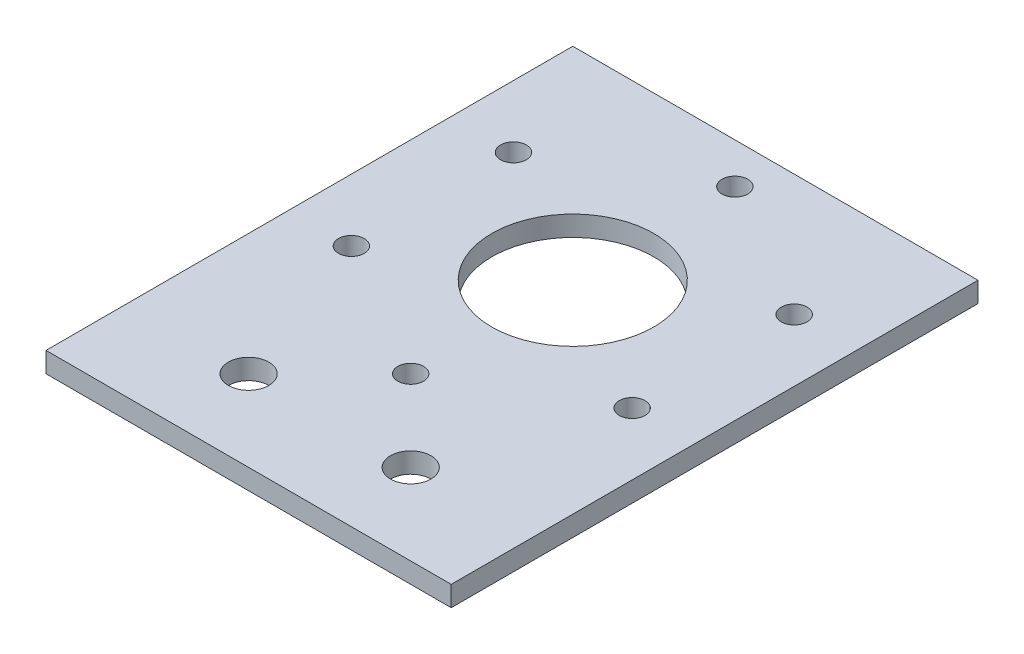
ISO-10303-21;
HEADER;
FILE_DESCRIPTION(('STEP AP214'),'2;1');
FILE_NAME('part.step','',(''),(''),'','','');
FILE_SCHEMA(('AUTOMOTIVE_DESIGN { 1 0 10303 214 1 1 1 1 }'));
ENDSEC;
DATA;
#1=APPLICATION_CONTEXT('core data for automotive mechanical design processes');
#2=APPLICATION_PROTOCOL_DEFINITION('international standard','automotive_design',2000,#1);
#3=PRODUCT_CONTEXT('',#1,'mechanical');
#4=PRODUCT('Part','Part','',(#3));
#5=PRODUCT_RELATED_PRODUCT_CATEGORY('part','',(#4));
#6=PRODUCT_DEFINITION_FORMATION('','',#4);
#7=PRODUCT_DEFINITION_CONTEXT('part definition',#1,'design');
#8=PRODUCT_DEFINITION('design','',#6,#7);
#9=PRODUCT_DEFINITION_SHAPE('','',#8);
#10=(LENGTH_UNIT() NAMED_UNIT(*) SI_UNIT(.MILLI.,.METRE.));
#11=(NAMED_UNIT(*) PLANE_ANGLE_UNIT() SI_UNIT($,.RADIAN.));
#12=(NAMED_UNIT(*) SI_UNIT($,.STERADIAN.) SOLID_ANGLE_UNIT());
#13=UNCERTAINTY_MEASURE_WITH_UNIT(LENGTH_MEASURE(1.E-05),#10,'distance_accuracy_value','');
#14=(GEOMETRIC_REPRESENTATION_CONTEXT(3) GLOBAL_UNCERTAINTY_ASSIGNED_CONTEXT((#13)) GLOBAL_UNIT_ASSIGNED_CONTEXT((#10,
#11,#12)) REPRESENTATION_CONTEXT('',''));
#15=CARTESIAN_POINT('',(0.,0.,0.));
#16=DIRECTION('',(0.,0.,1.));
#17=DIRECTION('',(1.,0.,0.));
#18=AXIS2_PLACEMENT_3D('',#15,#16,#17);
#19=CARTESIAN_POINT('',(0.,3.175,0.));
#20=DIRECTION('',(0.,-1.,0.));
#21=DIRECTION('',(0.,0.,-1.));
#22=AXIS2_PLACEMENT_3D('',#19,#20,#21);
#23=PLANE('',#22);
#24=CARTESIAN_POINT('',(19.05,3.175,-12.7));
#25=DIRECTION('',(0.,1.,0.));
#26=DIRECTION('',(0.,0.,1.));
#27=AXIS2_PLACEMENT_3D('',#24,#25,#26);
#28=CIRCLE('',#27,3.175);
#29=CARTESIAN_POINT('',(19.05,3.175,-9.525));
#30=VERTEX_POINT('',#29);
#31=EDGE_CURVE('E160',#30,#30,#28,.T.);
#32=ORIENTED_EDGE('',*,*,#31,.F.);
#33=EDGE_LOOP('',(#32));
#34=FACE_BOUND('',#33,.T.);
#35=CARTESIAN_POINT('',(44.45,3.175,-12.7));
#36=DIRECTION('',(0.,1.,0.));
#37=DIRECTION('',(0.,0.,1.));
#38=AXIS2_PLACEMENT_3D('',#35,#36,#37);
#39=CIRCLE('',#38,3.175);
#40=CARTESIAN_POINT('',(44.45,3.175,-9.525));
#41=VERTEX_POINT('',#40);
#42=EDGE_CURVE('E154',#41,#41,#39,.T.);
#43=ORIENTED_EDGE('',*,*,#42,.F.);
#44=EDGE_LOOP('',(#43));
#45=FACE_BOUND('',#44,.T.);
#46=DIRECTION('',(0.,0.,1.));
#47=VECTOR('',#46,1.);
#48=CARTESIAN_POINT('',(0.,3.175,0.));
#49=LINE('',#48,#47);
#50=CARTESIAN_POINT('',(0.,3.175,-82.55));
#51=VERTEX_POINT('',#50);
#52=CARTESIAN_POINT('',(0.,3.175,0.));
#53=VERTEX_POINT('',#52);
#54=EDGE_CURVE('E85',#51,#53,#49,.T.);
#55=ORIENTED_EDGE('',*,*,#54,.T.);
#56=DIRECTION('',(1.,0.,0.));
#57=VECTOR('',#56,1.);
#58=CARTESIAN_POINT('',(0.,3.175,0.));
#59=LINE('',#58,#57);
#60=CARTESIAN_POINT('',(63.5,3.175,0.));
#61=VERTEX_POINT('',#60);
#62=EDGE_CURVE('E80',#53,#61,#59,.T.);
#63=ORIENTED_EDGE('',*,*,#62,.T.);
#64=DIRECTION('',(0.,0.,-1.));
#65=VECTOR('',#64,1.);
#66=CARTESIAN_POINT('',(63.5,3.175,0.));
#67=LINE('',#66,#65);
#68=CARTESIAN_POINT('',(63.5,3.175,-82.55));
#69=VERTEX_POINT('',#68);
#70=EDGE_CURVE('E83',#61,#69,#67,.T.);
#71=ORIENTED_EDGE('',*,*,#70,.T.);
#72=DIRECTION('',(-1.,0.,0.));
#73=VECTOR('',#72,1.);
#74=CARTESIAN_POINT('',(0.,3.175,-82.55));
#75=LINE('',#74,#73);
#76=EDGE_CURVE('E50',#69,#51,#75,.T.);
#77=ORIENTED_EDGE('',*,*,#76,.T.);
#78=EDGE_LOOP('',(#55,#63,#71,#77));
#79=FACE_BOUND('',#78,.T.);
#80=CARTESIAN_POINT('',(31.75,3.175,-50.8));
#81=DIRECTION('',(0.,1.,0.));
#82=DIRECTION('',(0.,0.,1.));
#83=AXIS2_PLACEMENT_3D('',#80,#81,#82);
#84=CIRCLE('',#83,12.7);
#85=CARTESIAN_POINT('',(31.75,3.175,-38.1));
#86=VERTEX_POINT('',#85);
#87=EDGE_CURVE('E100',#86,#86,#84,.T.);
#88=ORIENTED_EDGE('',*,*,#87,.F.);
#89=EDGE_LOOP('',(#88));
#90=FACE_BOUND('',#89,.T.);
#91=CARTESIAN_POINT('',(9.75295474387527,3.175,-63.5));
#92=DIRECTION('',(0.,1.,0.));
#93=DIRECTION('',(0.,0.,1.));
#94=AXIS2_PLACEMENT_3D('',#91,#92,#93);
#95=CIRCLE('',#94,2.0193);
#96=CARTESIAN_POINT('',(9.75295474387527,3.175,-61.4807));
#97=VERTEX_POINT('',#96);
#98=EDGE_CURVE('E115',#97,#97,#95,.T.);
#99=ORIENTED_EDGE('',*,*,#98,.F.);
#100=EDGE_LOOP('',(#99));
#101=FACE_BOUND('',#100,.T.);
#102=CARTESIAN_POINT('',(31.75,3.175,-76.2));
#103=DIRECTION('',(0.,1.,0.));
#104=DIRECTION('',(0.,0.,1.));
#105=AXIS2_PLACEMENT_3D('',#102,#103,#104);
#106=CIRCLE('',#105,2.0193);
#107=CARTESIAN_POINT('',(31.75,3.175,-74.1807));
#108=VERTEX_POINT('',#107);
#109=EDGE_CURVE('E121',#108,#108,#106,.T.);
#110=ORIENTED_EDGE('',*,*,#109,.F.);
#111=EDGE_LOOP('',(#110));
#112=FACE_BOUND('',#111,.T.);
#113=CARTESIAN_POINT('',(53.7470452561248,3.175,-63.5));
#114=DIRECTION('',(0.,1.,0.));
#115=DIRECTION('',(0.,0.,1.));
#116=AXIS2_PLACEMENT_3D('',#113,#114,#115);
#117=CIRCLE('',#116,2.0193);
#118=CARTESIAN_POINT('',(53.7470452561248,3.175,-61.4807));
#119=VERTEX_POINT('',#118);
#120=EDGE_CURVE('E127',#119,#119,#117,.T.);
#121=ORIENTED_EDGE('',*,*,#120,.F.);
#122=EDGE_LOOP('',(#121));
#123=FACE_BOUND('',#122,.T.);
#124=CARTESIAN_POINT('',(53.7470452561248,3.175,-38.1));
#125=DIRECTION('',(0.,1.,0.));
#126=DIRECTION('',(0.,0.,1.));
#127=AXIS2_PLACEMENT_3D('',#124,#125,#126);
#128=CIRCLE('',#127,2.0193);
#129=CARTESIAN_POINT('',(53.7470452561248,3.175,-36.0807));
#130=VERTEX_POINT('',#129);
#131=EDGE_CURVE('E133',#130,#130,#128,.T.);
#132=ORIENTED_EDGE('',*,*,#131,.F.);
#133=EDGE_LOOP('',(#132));
#134=FACE_BOUND('',#133,.T.);
#135=CARTESIAN_POINT('',(31.75,3.175,-25.4));
#136=DIRECTION('',(0.,1.,0.));
#137=DIRECTION('',(0.,0.,1.));
#138=AXIS2_PLACEMENT_3D('',#135,#136,#137);
#139=CIRCLE('',#138,2.0193);
#140=CARTESIAN_POINT('',(31.75,3.175,-23.3807));
#141=VERTEX_POINT('',#140);
#142=EDGE_CURVE('E139',#141,#141,#139,.T.);
#143=ORIENTED_EDGE('',*,*,#142,.F.);
#144=EDGE_LOOP('',(#143));
#145=FACE_BOUND('',#144,.T.);
#146=CARTESIAN_POINT('',(9.75295474387527,3.175,-38.1));
#147=DIRECTION('',(0.,1.,0.));
#148=DIRECTION('',(0.,0.,1.));
#149=AXIS2_PLACEMENT_3D('',#146,#147,#148);
#150=CIRCLE('',#149,2.0193);
#151=CARTESIAN_POINT('',(9.75295474387527,3.175,-36.0807));
#152=VERTEX_POINT('',#151);
#153=EDGE_CURVE('E145',#152,#152,#150,.T.);
#154=ORIENTED_EDGE('',*,*,#153,.F.);
#155=EDGE_LOOP('',(#154));
#156=FACE_BOUND('',#155,.T.);
#157=ADVANCED_FACE('F33',(#34,#45,#79,#90,#101,#112,#123,#134,#145,#156),#23,.F.);
#158=CARTESIAN_POINT('',(0.,0.,0.));
#159=DIRECTION('',(0.,-1.,0.));
#160=DIRECTION('',(0.,0.,-1.));
#161=AXIS2_PLACEMENT_3D('',#158,#159,#160);
#162=PLANE('',#161);
#163=CARTESIAN_POINT('',(19.05,0.,-12.7));
#164=DIRECTION('',(0.,1.,0.));
#165=DIRECTION('',(0.,0.,1.));
#166=AXIS2_PLACEMENT_3D('',#163,#164,#165);
#167=CIRCLE('',#166,3.175);
#168=CARTESIAN_POINT('',(19.05,0.,-9.525));
#169=VERTEX_POINT('',#168);
#170=EDGE_CURVE('E151',#169,#169,#167,.T.);
#171=ORIENTED_EDGE('',*,*,#170,.T.);
#172=EDGE_LOOP('',(#171));
#173=FACE_BOUND('',#172,.T.);
#174=CARTESIAN_POINT('',(44.45,0.,-12.7));
#175=DIRECTION('',(0.,1.,0.));
#176=DIRECTION('',(0.,0.,1.));
#177=AXIS2_PLACEMENT_3D('',#174,#175,#176);
#178=CIRCLE('',#177,3.175);
#179=CARTESIAN_POINT('',(44.45,0.,-9.525));
#180=VERTEX_POINT('',#179);
#181=EDGE_CURVE('E157',#180,#180,#178,.T.);
#182=ORIENTED_EDGE('',*,*,#181,.T.);
#183=EDGE_LOOP('',(#182));
#184=FACE_BOUND('',#183,.T.);
#185=CARTESIAN_POINT('',(31.75,0.,-25.4));
#186=DIRECTION('',(0.,1.,0.));
#187=DIRECTION('',(0.,0.,1.));
#188=AXIS2_PLACEMENT_3D('',#185,#186,#187);
#189=CIRCLE('',#188,2.0193);
#190=CARTESIAN_POINT('',(31.75,0.,-23.3807));
#191=VERTEX_POINT('',#190);
#192=EDGE_CURVE('E142',#191,#191,#189,.T.);
#193=ORIENTED_EDGE('',*,*,#192,.T.);
#194=EDGE_LOOP('',(#193));
#195=FACE_BOUND('',#194,.T.);
#196=CARTESIAN_POINT('',(53.7470452561248,0.,-63.5));
#197=DIRECTION('',(0.,1.,0.));
#198=DIRECTION('',(0.,0.,1.));
#199=AXIS2_PLACEMENT_3D('',#196,#197,#198);
#200=CIRCLE('',#199,2.0193);
#201=CARTESIAN_POINT('',(53.7470452561248,0.,-61.4807));
#202=VERTEX_POINT('',#201);
#203=EDGE_CURVE('E130',#202,#202,#200,.T.);
#204=ORIENTED_EDGE('',*,*,#203,.T.);
#205=EDGE_LOOP('',(#204));
#206=FACE_BOUND('',#205,.T.);
#207=CARTESIAN_POINT('',(9.75295474387527,0.,-63.5));
#208=DIRECTION('',(0.,1.,0.));
#209=DIRECTION('',(0.,0.,1.));
#210=AXIS2_PLACEMENT_3D('',#207,#208,#209);
#211=CIRCLE('',#210,2.0193);
#212=CARTESIAN_POINT('',(9.75295474387527,0.,-61.4807));
#213=VERTEX_POINT('',#212);
#214=EDGE_CURVE('E118',#213,#213,#211,.T.);
#215=ORIENTED_EDGE('',*,*,#214,.T.);
#216=EDGE_LOOP('',(#215));
#217=FACE_BOUND('',#216,.T.);
#218=DIRECTION('',(0.,0.,1.));
#219=VECTOR('',#218,1.);
#220=CARTESIAN_POINT('',(0.,0.,0.));
#221=LINE('',#220,#219);
#222=CARTESIAN_POINT('',(0.,0.,-82.55));
#223=VERTEX_POINT('',#222);
#224=CARTESIAN_POINT('',(0.,0.,0.));
#225=VERTEX_POINT('',#224);
#226=EDGE_CURVE('E97',#223,#225,#221,.T.);
#227=ORIENTED_EDGE('',*,*,#226,.F.);
#228=DIRECTION('',(-1.,0.,0.));
#229=VECTOR('',#228,1.);
#230=CARTESIAN_POINT('',(0.,0.,-82.55));
#231=LINE('',#230,#229);
#232=CARTESIAN_POINT('',(63.5,0.,-82.55));
#233=VERTEX_POINT('',#232);
#234=EDGE_CURVE('E73',#233,#223,#231,.T.);
#235=ORIENTED_EDGE('',*,*,#234,.F.);
#236=DIRECTION('',(0.,0.,-1.));
#237=VECTOR('',#236,1.);
#238=CARTESIAN_POINT('',(63.5,0.,0.));
#239=LINE('',#238,#237);
#240=CARTESIAN_POINT('',(63.5,0.,0.));
#241=VERTEX_POINT('',#240);
#242=EDGE_CURVE('E67',#241,#233,#239,.T.);
#243=ORIENTED_EDGE('',*,*,#242,.F.);
#244=DIRECTION('',(1.,0.,0.));
#245=VECTOR('',#244,1.);
#246=CARTESIAN_POINT('',(0.,0.,0.));
#247=LINE('',#246,#245);
#248=EDGE_CURVE('E89',#225,#241,#247,.T.);
#249=ORIENTED_EDGE('',*,*,#248,.F.);
#250=EDGE_LOOP('',(#227,#235,#243,#249));
#251=FACE_BOUND('',#250,.T.);
#252=CARTESIAN_POINT('',(31.75,0.,-50.8));
#253=DIRECTION('',(0.,1.,0.));
#254=DIRECTION('',(0.,0.,1.));
#255=AXIS2_PLACEMENT_3D('',#252,#253,#254);
#256=CIRCLE('',#255,12.7);
#257=CARTESIAN_POINT('',(31.75,0.,-38.1));
#258=VERTEX_POINT('',#257);
#259=EDGE_CURVE('E112',#258,#258,#256,.T.);
#260=ORIENTED_EDGE('',*,*,#259,.T.);
#261=EDGE_LOOP('',(#260));
#262=FACE_BOUND('',#261,.T.);
#263=CARTESIAN_POINT('',(31.75,0.,-76.2));
#264=DIRECTION('',(0.,1.,0.));
#265=DIRECTION('',(0.,0.,1.));
#266=AXIS2_PLACEMENT_3D('',#263,#264,#265);
#267=CIRCLE('',#266,2.0193);
#268=CARTESIAN_POINT('',(31.75,0.,-74.1807));
#269=VERTEX_POINT('',#268);
#270=EDGE_CURVE('E124',#269,#269,#267,.T.);
#271=ORIENTED_EDGE('',*,*,#270,.T.);
#272=EDGE_LOOP('',(#271));
#273=FACE_BOUND('',#272,.T.);
#274=CARTESIAN_POINT('',(53.7470452561248,0.,-38.1));
#275=DIRECTION('',(0.,1.,0.));
#276=DIRECTION('',(0.,0.,1.));
#277=AXIS2_PLACEMENT_3D('',#274,#275,#276);
#278=CIRCLE('',#277,2.0193);
#279=CARTESIAN_POINT('',(53.7470452561248,0.,-36.0807));
#280=VERTEX_POINT('',#279);
#281=EDGE_CURVE('E136',#280,#280,#278,.T.);
#282=ORIENTED_EDGE('',*,*,#281,.T.);
#283=EDGE_LOOP('',(#282));
#284=FACE_BOUND('',#283,.T.);
#285=CARTESIAN_POINT('',(9.75295474387527,0.,-38.1));
#286=DIRECTION('',(0.,1.,0.));
#287=DIRECTION('',(0.,0.,1.));
#288=AXIS2_PLACEMENT_3D('',#285,#286,#287);
#289=CIRCLE('',#288,2.0193);
#290=CARTESIAN_POINT('',(9.75295474387527,0.,-36.0807));
#291=VERTEX_POINT('',#290);
#292=EDGE_CURVE('E148',#291,#291,#289,.T.);
#293=ORIENTED_EDGE('',*,*,#292,.T.);
#294=EDGE_LOOP('',(#293));
#295=FACE_BOUND('',#294,.T.);
#296=ADVANCED_FACE('F108',(#173,#184,#195,#206,#217,#251,#262,#273,#284,#295),#162,.T.);
#297=CARTESIAN_POINT('',(0.,3.175,0.));
#298=DIRECTION('',(1.,0.,0.));
#299=DIRECTION('',(0.,0.,-1.));
#300=AXIS2_PLACEMENT_3D('',#297,#298,#299);
#301=PLANE('',#300);
#302=ORIENTED_EDGE('',*,*,#226,.T.);
#303=DIRECTION('',(0.,-1.,0.));
#304=VECTOR('',#303,1.);
#305=CARTESIAN_POINT('',(0.,3.175,0.));
#306=LINE('',#305,#304);
#307=EDGE_CURVE('E11',#53,#225,#306,.T.);
#308=ORIENTED_EDGE('',*,*,#307,.F.);
#309=ORIENTED_EDGE('',*,*,#54,.F.);
#310=DIRECTION('',(0.,-1.,0.));
#311=VECTOR('',#310,1.);
#312=CARTESIAN_POINT('',(0.,3.175,-82.55));
#313=LINE('',#312,#311);
#314=EDGE_CURVE('E93',#51,#223,#313,.T.);
#315=ORIENTED_EDGE('',*,*,#314,.T.);
#316=EDGE_LOOP('',(#302,#308,#309,#315));
#317=FACE_BOUND('',#316,.T.);
#318=ADVANCED_FACE('F35',(#317),#301,.F.);
#319=CARTESIAN_POINT('',(0.,3.175,0.));
#320=DIRECTION('',(0.,0.,-1.));
#321=DIRECTION('',(-1.,0.,0.));
#322=AXIS2_PLACEMENT_3D('',#319,#320,#321);
#323=PLANE('',#322);
#324=ORIENTED_EDGE('',*,*,#248,.T.);
#325=DIRECTION('',(0.,-1.,0.));
#326=VECTOR('',#325,1.);
#327=CARTESIAN_POINT('',(63.5,3.175,0.));
#328=LINE('',#327,#326);
#329=EDGE_CURVE('E42',#61,#241,#328,.T.);
#330=ORIENTED_EDGE('',*,*,#329,.F.);
#331=ORIENTED_EDGE('',*,*,#62,.F.);
#332=ORIENTED_EDGE('',*,*,#307,.T.);
#333=EDGE_LOOP('',(#324,#330,#331,#332));
#334=FACE_BOUND('',#333,.T.);
#335=ADVANCED_FACE('F88',(#334),#323,.F.);
#336=CARTESIAN_POINT('',(63.5,3.175,0.));
#337=DIRECTION('',(-1.,0.,0.));
#338=DIRECTION('',(0.,0.,1.));
#339=AXIS2_PLACEMENT_3D('',#336,#337,#338);
#340=PLANE('',#339);
#341=ORIENTED_EDGE('',*,*,#242,.T.);
#342=DIRECTION('',(0.,-1.,0.));
#343=VECTOR('',#342,1.);
#344=CARTESIAN_POINT('',(63.5,3.175,-82.55));
#345=LINE('',#344,#343);
#346=EDGE_CURVE('E90',#69,#233,#345,.T.);
#347=ORIENTED_EDGE('',*,*,#346,.F.);
#348=ORIENTED_EDGE('',*,*,#70,.F.);
#349=ORIENTED_EDGE('',*,*,#329,.T.);
#350=EDGE_LOOP('',(#341,#347,#348,#349));
#351=FACE_BOUND('',#350,.T.);
#352=ADVANCED_FACE('F91',(#351),#340,.F.);
#353=CARTESIAN_POINT('',(0.,3.175,-82.55));
#354=DIRECTION('',(0.,0.,1.));
#355=DIRECTION('',(1.,0.,0.));
#356=AXIS2_PLACEMENT_3D('',#353,#354,#355);
#357=PLANE('',#356);
#358=ORIENTED_EDGE('',*,*,#234,.T.);
#359=ORIENTED_EDGE('',*,*,#314,.F.);
#360=ORIENTED_EDGE('',*,*,#76,.F.);
#361=ORIENTED_EDGE('',*,*,#346,.T.);
#362=EDGE_LOOP('',(#358,#359,#360,#361));
#363=FACE_BOUND('',#362,.T.);
#364=ADVANCED_FACE('F105',(#363),#357,.F.);
#365=CARTESIAN_POINT('',(31.75,3.175,-50.8));
#366=DIRECTION('',(0.,-1.,0.));
#367=DIRECTION('',(0.,0.,-1.));
#368=AXIS2_PLACEMENT_3D('',#365,#366,#367);
#369=CYLINDRICAL_SURFACE('',#368,12.7);
#370=ORIENTED_EDGE('',*,*,#87,.T.);
#371=EDGE_LOOP('',(#370));
#372=FACE_BOUND('',#371,.T.);
#373=ORIENTED_EDGE('',*,*,#259,.F.);
#374=EDGE_LOOP('',(#373));
#375=FACE_BOUND('',#374,.T.);
#376=ADVANCED_FACE('F210',(#372,#375),#369,.F.);
#377=CARTESIAN_POINT('',(9.75295474387527,3.175,-63.5));
#378=DIRECTION('',(0.,-1.,0.));
#379=DIRECTION('',(0.,0.,-1.));
#380=AXIS2_PLACEMENT_3D('',#377,#378,#379);
#381=CYLINDRICAL_SURFACE('',#380,2.0193);
#382=ORIENTED_EDGE('',*,*,#98,.T.);
#383=EDGE_LOOP('',(#382));
#384=FACE_BOUND('',#383,.T.);
#385=ORIENTED_EDGE('',*,*,#214,.F.);
#386=EDGE_LOOP('',(#385));
#387=FACE_BOUND('',#386,.T.);
#388=ADVANCED_FACE('F206',(#384,#387),#381,.F.);
#389=CARTESIAN_POINT('',(31.75,3.175,-76.2));
#390=DIRECTION('',(0.,-1.,0.));
#391=DIRECTION('',(0.,0.,-1.));
#392=AXIS2_PLACEMENT_3D('',#389,#390,#391);
#393=CYLINDRICAL_SURFACE('',#392,2.0193);
#394=ORIENTED_EDGE('',*,*,#109,.T.);
#395=EDGE_LOOP('',(#394));
#396=FACE_BOUND('',#395,.T.);
#397=ORIENTED_EDGE('',*,*,#270,.F.);
#398=EDGE_LOOP('',(#397));
#399=FACE_BOUND('',#398,.T.);
#400=ADVANCED_FACE('F202',(#396,#399),#393,.F.);
#401=CARTESIAN_POINT('',(53.7470452561248,3.175,-63.5));
#402=DIRECTION('',(0.,-1.,0.));
#403=DIRECTION('',(0.,0.,-1.));
#404=AXIS2_PLACEMENT_3D('',#401,#402,#403);
#405=CYLINDRICAL_SURFACE('',#404,2.0193);
#406=ORIENTED_EDGE('',*,*,#120,.T.);
#407=EDGE_LOOP('',(#406));
#408=FACE_BOUND('',#407,.T.);
#409=ORIENTED_EDGE('',*,*,#203,.F.);
#410=EDGE_LOOP('',(#409));
#411=FACE_BOUND('',#410,.T.);
#412=ADVANCED_FACE('F198',(#408,#411),#405,.F.);
#413=CARTESIAN_POINT('',(53.7470452561248,3.175,-38.1));
#414=DIRECTION('',(0.,-1.,0.));
#415=DIRECTION('',(0.,0.,-1.));
#416=AXIS2_PLACEMENT_3D('',#413,#414,#415);
#417=CYLINDRICAL_SURFACE('',#416,2.0193);
#418=ORIENTED_EDGE('',*,*,#131,.T.);
#419=EDGE_LOOP('',(#418));
#420=FACE_BOUND('',#419,.T.);
#421=ORIENTED_EDGE('',*,*,#281,.F.);
#422=EDGE_LOOP('',(#421));
#423=FACE_BOUND('',#422,.T.);
#424=ADVANCED_FACE('F194',(#420,#423),#417,.F.);
#425=CARTESIAN_POINT('',(31.75,3.175,-25.4));
#426=DIRECTION('',(0.,-1.,0.));
#427=DIRECTION('',(0.,0.,-1.));
#428=AXIS2_PLACEMENT_3D('',#425,#426,#427);
#429=CYLINDRICAL_SURFACE('',#428,2.0193);
#430=ORIENTED_EDGE('',*,*,#142,.T.);
#431=EDGE_LOOP('',(#430));
#432=FACE_BOUND('',#431,.T.);
#433=ORIENTED_EDGE('',*,*,#192,.F.);
#434=EDGE_LOOP('',(#433));
#435=FACE_BOUND('',#434,.T.);
#436=ADVANCED_FACE('F187',(#432,#435),#429,.F.);
#437=CARTESIAN_POINT('',(9.75295474387527,3.175,-38.1));
#438=DIRECTION('',(0.,-1.,0.));
#439=DIRECTION('',(0.,0.,-1.));
#440=AXIS2_PLACEMENT_3D('',#437,#438,#439);
#441=CYLINDRICAL_SURFACE('',#440,2.0193);
#442=ORIENTED_EDGE('',*,*,#153,.T.);
#443=EDGE_LOOP('',(#442));
#444=FACE_BOUND('',#443,.T.);
#445=ORIENTED_EDGE('',*,*,#292,.F.);
#446=EDGE_LOOP('',(#445));
#447=FACE_BOUND('',#446,.T.);
#448=ADVANCED_FACE('F181',(#444,#447),#441,.F.);
#449=CARTESIAN_POINT('',(44.45,0.,-12.7));
#450=DIRECTION('',(0.,1.,0.));
#451=DIRECTION('',(0.,0.,1.));
#452=AXIS2_PLACEMENT_3D('',#449,#450,#451);
#453=CYLINDRICAL_SURFACE('',#452,3.175);
#454=ORIENTED_EDGE('',*,*,#181,.F.);
#455=EDGE_LOOP('',(#454));
#456=FACE_BOUND('',#455,.T.);
#457=ORIENTED_EDGE('',*,*,#42,.T.);
#458=EDGE_LOOP('',(#457));
#459=FACE_BOUND('',#458,.T.);
#460=ADVANCED_FACE('F171',(#456,#459),#453,.F.);
#461=CARTESIAN_POINT('',(19.05,0.,-12.7));
#462=DIRECTION('',(0.,1.,0.));
#463=DIRECTION('',(0.,0.,1.));
#464=AXIS2_PLACEMENT_3D('',#461,#462,#463);
#465=CYLINDRICAL_SURFACE('',#464,3.175);
#466=ORIENTED_EDGE('',*,*,#170,.F.);
#467=EDGE_LOOP('',(#466));
#468=FACE_BOUND('',#467,.T.);
#469=ORIENTED_EDGE('',*,*,#31,.T.);
#470=EDGE_LOOP('',(#469));
#471=FACE_BOUND('',#470,.T.);
#472=ADVANCED_FACE('F168',(#468,#471),#465,.F.);
#473=CLOSED_SHELL('',(#157,#296,#318,#335,#352,#364,#376,#388,#400,#412,#424,#436,#448,#460,#472));
#474=MANIFOLD_SOLID_BREP('B2',#473);
#475=ADVANCED_BREP_SHAPE_REPRESENTATION('',(#18,#474),#14);
#476=SHAPE_DEFINITION_REPRESENTATION(#9,#475);
ENDSEC;
END-ISO-10303-21;
